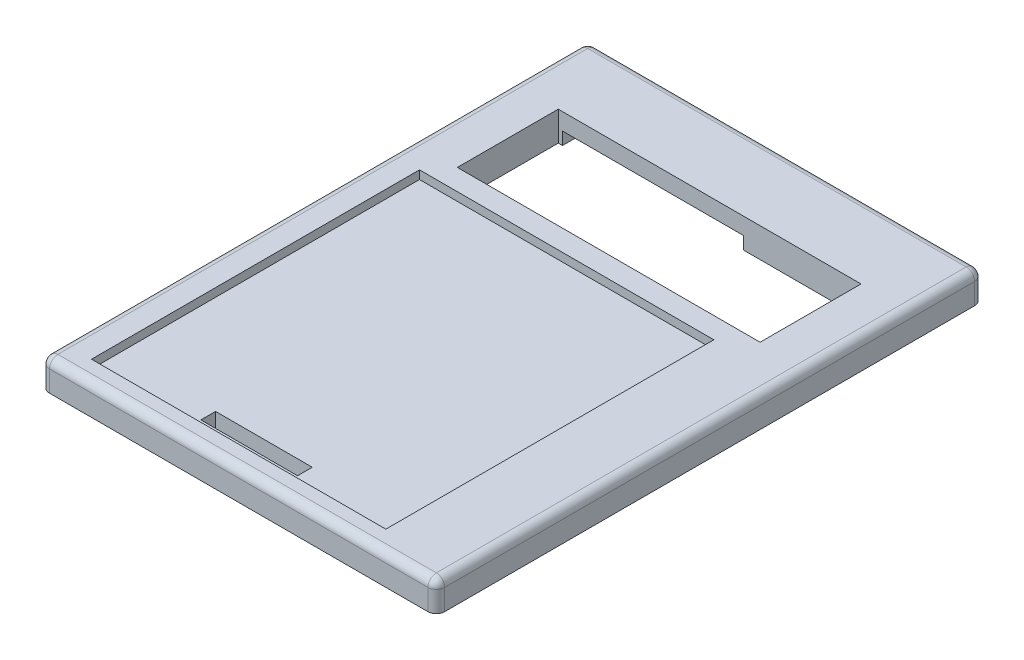
ISO-10303-21;
HEADER;
FILE_DESCRIPTION(('STEP AP214'),'2;1');
FILE_NAME('part.step','',(''),(''),'','','');
FILE_SCHEMA(('AUTOMOTIVE_DESIGN { 1 0 10303 214 1 1 1 1 }'));
ENDSEC;
DATA;
#1=APPLICATION_CONTEXT('core data for automotive mechanical design processes');
#2=APPLICATION_PROTOCOL_DEFINITION('international standard','automotive_design',2000,#1);
#3=PRODUCT_CONTEXT('',#1,'mechanical');
#4=PRODUCT('Part','Part','',(#3));
#5=PRODUCT_RELATED_PRODUCT_CATEGORY('part','',(#4));
#6=PRODUCT_DEFINITION_FORMATION('','',#4);
#7=PRODUCT_DEFINITION_CONTEXT('part definition',#1,'design');
#8=PRODUCT_DEFINITION('design','',#6,#7);
#9=PRODUCT_DEFINITION_SHAPE('','',#8);
#10=(LENGTH_UNIT() NAMED_UNIT(*) SI_UNIT(.MILLI.,.METRE.));
#11=(NAMED_UNIT(*) PLANE_ANGLE_UNIT() SI_UNIT($,.RADIAN.));
#12=(NAMED_UNIT(*) SI_UNIT($,.STERADIAN.) SOLID_ANGLE_UNIT());
#13=UNCERTAINTY_MEASURE_WITH_UNIT(LENGTH_MEASURE(1.E-05),#10,'distance_accuracy_value','');
#14=(GEOMETRIC_REPRESENTATION_CONTEXT(3) GLOBAL_UNCERTAINTY_ASSIGNED_CONTEXT((#13)) GLOBAL_UNIT_ASSIGNED_CONTEXT((#10,
#11,#12)) REPRESENTATION_CONTEXT('',''));
#15=CARTESIAN_POINT('',(0.,0.,0.));
#16=DIRECTION('',(0.,0.,1.));
#17=DIRECTION('',(1.,0.,0.));
#18=AXIS2_PLACEMENT_3D('',#15,#16,#17);
#19=CARTESIAN_POINT('',(0.,7.,0.));
#20=DIRECTION('',(1.,0.,0.));
#21=DIRECTION('',(0.,0.,-1.));
#22=AXIS2_PLACEMENT_3D('',#19,#20,#21);
#23=PLANE('',#22);
#24=DIRECTION('',(0.,0.,1.));
#25=VECTOR('',#24,1.);
#26=CARTESIAN_POINT('',(0.,5.,0.));
#27=LINE('',#26,#25);
#28=CARTESIAN_POINT('',(0.,5.,-2.));
#29=VERTEX_POINT('',#28);
#30=CARTESIAN_POINT('',(0.,5.,-128.));
#31=VERTEX_POINT('',#30);
#32=EDGE_CURVE('E506',#29,#31,#27,.F.);
#33=ORIENTED_EDGE('',*,*,#32,.T.);
#34=DIRECTION('',(0.,-1.,0.));
#35=VECTOR('',#34,1.);
#36=CARTESIAN_POINT('',(0.,7.,-128.));
#37=LINE('',#36,#35);
#38=CARTESIAN_POINT('',(0.,0.,-128.));
#39=VERTEX_POINT('',#38);
#40=EDGE_CURVE('E512',#31,#39,#37,.T.);
#41=ORIENTED_EDGE('',*,*,#40,.T.);
#42=DIRECTION('',(0.,0.,1.));
#43=VECTOR('',#42,1.);
#44=CARTESIAN_POINT('',(0.,0.,0.));
#45=LINE('',#44,#43);
#46=CARTESIAN_POINT('',(0.,0.,-2.));
#47=VERTEX_POINT('',#46);
#48=EDGE_CURVE('E450',#39,#47,#45,.T.);
#49=ORIENTED_EDGE('',*,*,#48,.T.);
#50=DIRECTION('',(0.,-1.,0.));
#51=VECTOR('',#50,1.);
#52=CARTESIAN_POINT('',(0.,7.,-2.));
#53=LINE('',#52,#51);
#54=EDGE_CURVE('E509',#47,#29,#53,.F.);
#55=ORIENTED_EDGE('',*,*,#54,.T.);
#56=EDGE_LOOP('',(#33,#41,#49,#55));
#57=FACE_BOUND('',#56,.T.);
#58=ADVANCED_FACE('F39',(#57),#23,.F.);
#59=CARTESIAN_POINT('',(0.,7.,0.));
#60=DIRECTION('',(0.,0.,-1.));
#61=DIRECTION('',(-1.,0.,0.));
#62=AXIS2_PLACEMENT_3D('',#59,#60,#61);
#63=PLANE('',#62);
#64=DIRECTION('',(1.,0.,0.));
#65=VECTOR('',#64,1.);
#66=CARTESIAN_POINT('',(0.,5.,0.));
#67=LINE('',#66,#65);
#68=CARTESIAN_POINT('',(92.,5.,0.));
#69=VERTEX_POINT('',#68);
#70=CARTESIAN_POINT('',(2.,5.,0.));
#71=VERTEX_POINT('',#70);
#72=EDGE_CURVE('E515',#69,#71,#67,.F.);
#73=ORIENTED_EDGE('',*,*,#72,.T.);
#74=DIRECTION('',(0.,-1.,0.));
#75=VECTOR('',#74,1.);
#76=CARTESIAN_POINT('',(2.,7.,0.));
#77=LINE('',#76,#75);
#78=CARTESIAN_POINT('',(2.,0.,0.));
#79=VERTEX_POINT('',#78);
#80=EDGE_CURVE('E521',#71,#79,#77,.T.);
#81=ORIENTED_EDGE('',*,*,#80,.T.);
#82=DIRECTION('',(1.,0.,0.));
#83=VECTOR('',#82,1.);
#84=CARTESIAN_POINT('',(0.,0.,0.));
#85=LINE('',#84,#83);
#86=CARTESIAN_POINT('',(92.,0.,0.));
#87=VERTEX_POINT('',#86);
#88=EDGE_CURVE('E463',#79,#87,#85,.T.);
#89=ORIENTED_EDGE('',*,*,#88,.T.);
#90=DIRECTION('',(0.,-1.,0.));
#91=VECTOR('',#90,1.);
#92=CARTESIAN_POINT('',(92.,7.,0.));
#93=LINE('',#92,#91);
#94=EDGE_CURVE('E518',#87,#69,#93,.F.);
#95=ORIENTED_EDGE('',*,*,#94,.T.);
#96=EDGE_LOOP('',(#73,#81,#89,#95));
#97=FACE_BOUND('',#96,.T.);
#98=ADVANCED_FACE('F590',(#97),#63,.F.);
#99=CARTESIAN_POINT('',(94.,7.,0.));
#100=DIRECTION('',(-1.,0.,0.));
#101=DIRECTION('',(0.,0.,1.));
#102=AXIS2_PLACEMENT_3D('',#99,#100,#101);
#103=PLANE('',#102);
#104=DIRECTION('',(0.,0.,-1.));
#105=VECTOR('',#104,1.);
#106=CARTESIAN_POINT('',(94.,0.,0.));
#107=LINE('',#106,#105);
#108=CARTESIAN_POINT('',(94.,0.,-2.));
#109=VERTEX_POINT('',#108);
#110=CARTESIAN_POINT('',(94.,0.,-128.));
#111=VERTEX_POINT('',#110);
#112=EDGE_CURVE('E467',#109,#111,#107,.T.);
#113=ORIENTED_EDGE('',*,*,#112,.T.);
#114=DIRECTION('',(0.,-1.,0.));
#115=VECTOR('',#114,1.);
#116=CARTESIAN_POINT('',(94.,7.,-128.));
#117=LINE('',#116,#115);
#118=CARTESIAN_POINT('',(94.,5.,-128.));
#119=VERTEX_POINT('',#118);
#120=EDGE_CURVE('E503',#111,#119,#117,.F.);
#121=ORIENTED_EDGE('',*,*,#120,.T.);
#122=DIRECTION('',(0.,0.,-1.));
#123=VECTOR('',#122,1.);
#124=CARTESIAN_POINT('',(94.,5.,0.));
#125=LINE('',#124,#123);
#126=CARTESIAN_POINT('',(94.,5.,-2.));
#127=VERTEX_POINT('',#126);
#128=EDGE_CURVE('E497',#119,#127,#125,.F.);
#129=ORIENTED_EDGE('',*,*,#128,.T.);
#130=DIRECTION('',(0.,-1.,0.));
#131=VECTOR('',#130,1.);
#132=CARTESIAN_POINT('',(94.,7.,-2.));
#133=LINE('',#132,#131);
#134=EDGE_CURVE('E500',#127,#109,#133,.T.);
#135=ORIENTED_EDGE('',*,*,#134,.T.);
#136=EDGE_LOOP('',(#113,#121,#129,#135));
#137=FACE_BOUND('',#136,.T.);
#138=ADVANCED_FACE('F628',(#137),#103,.F.);
#139=CARTESIAN_POINT('',(0.,7.,-130.));
#140=DIRECTION('',(0.,0.,1.));
#141=DIRECTION('',(1.,0.,0.));
#142=AXIS2_PLACEMENT_3D('',#139,#140,#141);
#143=PLANE('',#142);
#144=DIRECTION('',(-1.,0.,0.));
#145=VECTOR('',#144,1.);
#146=CARTESIAN_POINT('',(0.,5.,-130.));
#147=LINE('',#146,#145);
#148=CARTESIAN_POINT('',(2.,5.,-130.));
#149=VERTEX_POINT('',#148);
#150=CARTESIAN_POINT('',(92.,5.,-130.));
#151=VERTEX_POINT('',#150);
#152=EDGE_CURVE('E475',#149,#151,#147,.F.);
#153=ORIENTED_EDGE('',*,*,#152,.T.);
#154=DIRECTION('',(0.,-1.,0.));
#155=VECTOR('',#154,1.);
#156=CARTESIAN_POINT('',(92.,7.,-130.));
#157=LINE('',#156,#155);
#158=CARTESIAN_POINT('',(92.,0.,-130.));
#159=VERTEX_POINT('',#158);
#160=EDGE_CURVE('E481',#151,#159,#157,.T.);
#161=ORIENTED_EDGE('',*,*,#160,.T.);
#162=DIRECTION('',(-1.,0.,0.));
#163=VECTOR('',#162,1.);
#164=CARTESIAN_POINT('',(0.,0.,-130.));
#165=LINE('',#164,#163);
#166=CARTESIAN_POINT('',(2.,0.,-130.));
#167=VERTEX_POINT('',#166);
#168=EDGE_CURVE('E471',#159,#167,#165,.T.);
#169=ORIENTED_EDGE('',*,*,#168,.T.);
#170=DIRECTION('',(0.,-1.,0.));
#171=VECTOR('',#170,1.);
#172=CARTESIAN_POINT('',(2.,7.,-130.));
#173=LINE('',#172,#171);
#174=EDGE_CURVE('E478',#167,#149,#173,.F.);
#175=ORIENTED_EDGE('',*,*,#174,.T.);
#176=EDGE_LOOP('',(#153,#161,#169,#175));
#177=FACE_BOUND('',#176,.T.);
#178=ADVANCED_FACE('F619',(#177),#143,.F.);
#179=CARTESIAN_POINT('',(0.,7.,0.));
#180=DIRECTION('',(0.,-1.,0.));
#181=DIRECTION('',(0.,0.,-1.));
#182=AXIS2_PLACEMENT_3D('',#179,#180,#181);
#183=PLANE('',#182);
#184=DIRECTION('',(0.,0.,1.));
#185=VECTOR('',#184,1.);
#186=CARTESIAN_POINT('',(2.,7.,0.));
#187=LINE('',#186,#185);
#188=CARTESIAN_POINT('',(2.,7.,-128.));
#189=VERTEX_POINT('',#188);
#190=CARTESIAN_POINT('',(2.,7.,-2.));
#191=VERTEX_POINT('',#190);
#192=EDGE_CURVE('E524',#189,#191,#187,.T.);
#193=ORIENTED_EDGE('',*,*,#192,.T.);
#194=DIRECTION('',(1.,0.,0.));
#195=VECTOR('',#194,1.);
#196=CARTESIAN_POINT('',(0.,7.,-2.));
#197=LINE('',#196,#195);
#198=CARTESIAN_POINT('',(92.,7.,-2.));
#199=VERTEX_POINT('',#198);
#200=EDGE_CURVE('E11',#191,#199,#197,.T.);
#201=ORIENTED_EDGE('',*,*,#200,.T.);
#202=DIRECTION('',(0.,0.,-1.));
#203=VECTOR('',#202,1.);
#204=CARTESIAN_POINT('',(92.,7.,0.));
#205=LINE('',#204,#203);
#206=CARTESIAN_POINT('',(92.,7.,-128.));
#207=VERTEX_POINT('',#206);
#208=EDGE_CURVE('E49',#199,#207,#205,.T.);
#209=ORIENTED_EDGE('',*,*,#208,.T.);
#210=DIRECTION('',(-1.,0.,0.));
#211=VECTOR('',#210,1.);
#212=CARTESIAN_POINT('',(0.,7.,-128.));
#213=LINE('',#212,#211);
#214=EDGE_CURVE('E527',#207,#189,#213,.T.);
#215=ORIENTED_EDGE('',*,*,#214,.T.);
#216=EDGE_LOOP('',(#193,#201,#209,#215));
#217=FACE_BOUND('',#216,.T.);
#218=DIRECTION('',(1.,0.,0.));
#219=VECTOR('',#218,1.);
#220=CARTESIAN_POINT('',(7.00000000000001,7.,-5.));
#221=LINE('',#220,#219);
#222=CARTESIAN_POINT('',(7.00000000000001,7.,-5.));
#223=VERTEX_POINT('',#222);
#224=CARTESIAN_POINT('',(77.,7.,-5.));
#225=VERTEX_POINT('',#224);
#226=EDGE_CURVE('E313',#223,#225,#221,.T.);
#227=ORIENTED_EDGE('',*,*,#226,.F.);
#228=DIRECTION('',(0.,0.,1.));
#229=VECTOR('',#228,1.);
#230=CARTESIAN_POINT('',(7.,7.,-83.));
#231=LINE('',#230,#229);
#232=CARTESIAN_POINT('',(7.,7.,-83.));
#233=VERTEX_POINT('',#232);
#234=EDGE_CURVE('E287',#233,#223,#231,.T.);
#235=ORIENTED_EDGE('',*,*,#234,.F.);
#236=DIRECTION('',(-1.,0.,0.));
#237=VECTOR('',#236,1.);
#238=CARTESIAN_POINT('',(7.,7.,-83.));
#239=LINE('',#238,#237);
#240=CARTESIAN_POINT('',(77.,7.,-83.));
#241=VERTEX_POINT('',#240);
#242=EDGE_CURVE('E298',#241,#233,#239,.T.);
#243=ORIENTED_EDGE('',*,*,#242,.F.);
#244=DIRECTION('',(0.,0.,-1.));
#245=VECTOR('',#244,1.);
#246=CARTESIAN_POINT('',(77.,7.,-83.));
#247=LINE('',#246,#245);
#248=EDGE_CURVE('E317',#225,#241,#247,.T.);
#249=ORIENTED_EDGE('',*,*,#248,.F.);
#250=EDGE_LOOP('',(#227,#235,#243,#249));
#251=FACE_BOUND('',#250,.T.);
#252=DIRECTION('',(1.,0.,0.));
#253=VECTOR('',#252,1.);
#254=CARTESIAN_POINT('',(11.,7.,-88.));
#255=LINE('',#254,#253);
#256=CARTESIAN_POINT('',(11.,7.,-88.));
#257=VERTEX_POINT('',#256);
#258=CARTESIAN_POINT('',(83.,7.,-88.));
#259=VERTEX_POINT('',#258);
#260=EDGE_CURVE('E436',#257,#259,#255,.T.);
#261=ORIENTED_EDGE('',*,*,#260,.F.);
#262=DIRECTION('',(0.,0.,1.));
#263=VECTOR('',#262,1.);
#264=CARTESIAN_POINT('',(11.,7.,-112.));
#265=LINE('',#264,#263);
#266=CARTESIAN_POINT('',(11.,7.,-112.));
#267=VERTEX_POINT('',#266);
#268=EDGE_CURVE('E404',#267,#257,#265,.T.);
#269=ORIENTED_EDGE('',*,*,#268,.F.);
#270=DIRECTION('',(-1.,0.,0.));
#271=VECTOR('',#270,1.);
#272=CARTESIAN_POINT('',(11.,7.,-112.));
#273=LINE('',#272,#271);
#274=CARTESIAN_POINT('',(83.,7.,-112.));
#275=VERTEX_POINT('',#274);
#276=EDGE_CURVE('E419',#275,#267,#273,.T.);
#277=ORIENTED_EDGE('',*,*,#276,.F.);
#278=DIRECTION('',(0.,0.,-1.));
#279=VECTOR('',#278,1.);
#280=CARTESIAN_POINT('',(83.,7.,-112.));
#281=LINE('',#280,#279);
#282=EDGE_CURVE('E440',#259,#275,#281,.T.);
#283=ORIENTED_EDGE('',*,*,#282,.F.);
#284=EDGE_LOOP('',(#261,#269,#277,#283));
#285=FACE_BOUND('',#284,.T.);
#286=ADVANCED_FACE('F604',(#217,#251,#285),#183,.F.);
#287=CARTESIAN_POINT('',(0.,0.,0.));
#288=DIRECTION('',(0.,-1.,0.));
#289=DIRECTION('',(0.,0.,-1.));
#290=AXIS2_PLACEMENT_3D('',#287,#288,#289);
#291=PLANE('',#290);
#292=DIRECTION('',(0.,0.,1.));
#293=VECTOR('',#292,1.);
#294=CARTESIAN_POINT('',(30.5,0.,-11.));
#295=LINE('',#294,#293);
#296=CARTESIAN_POINT('',(30.5,0.,-11.));
#297=VERTEX_POINT('',#296);
#298=CARTESIAN_POINT('',(30.5,0.,-7.5));
#299=VERTEX_POINT('',#298);
#300=EDGE_CURVE('E241',#297,#299,#295,.T.);
#301=ORIENTED_EDGE('',*,*,#300,.T.);
#302=DIRECTION('',(1.,0.,0.));
#303=VECTOR('',#302,1.);
#304=CARTESIAN_POINT('',(30.5,0.,-7.5));
#305=LINE('',#304,#303);
#306=CARTESIAN_POINT('',(53.5,0.,-7.5));
#307=VERTEX_POINT('',#306);
#308=EDGE_CURVE('E254',#299,#307,#305,.T.);
#309=ORIENTED_EDGE('',*,*,#308,.T.);
#310=DIRECTION('',(0.,0.,-1.));
#311=VECTOR('',#310,1.);
#312=CARTESIAN_POINT('',(53.5,0.,-11.));
#313=LINE('',#312,#311);
#314=CARTESIAN_POINT('',(53.5,0.,-11.));
#315=VERTEX_POINT('',#314);
#316=EDGE_CURVE('E259',#307,#315,#313,.T.);
#317=ORIENTED_EDGE('',*,*,#316,.T.);
#318=DIRECTION('',(-1.,0.,0.));
#319=VECTOR('',#318,1.);
#320=CARTESIAN_POINT('',(30.5,0.,-11.));
#321=LINE('',#320,#319);
#322=EDGE_CURVE('E250',#315,#297,#321,.T.);
#323=ORIENTED_EDGE('',*,*,#322,.T.);
#324=EDGE_LOOP('',(#301,#309,#317,#323));
#325=FACE_BOUND('',#324,.T.);
#326=DIRECTION('',(0.,0.,1.));
#327=VECTOR('',#326,1.);
#328=CARTESIAN_POINT('',(55.,0.,-119.5));
#329=LINE('',#328,#327);
#330=CARTESIAN_POINT('',(55.,0.,-119.5));
#331=VERTEX_POINT('',#330);
#332=CARTESIAN_POINT('',(55.,0.,-112.));
#333=VERTEX_POINT('',#332);
#334=EDGE_CURVE('E327',#331,#333,#329,.T.);
#335=ORIENTED_EDGE('',*,*,#334,.F.);
#336=DIRECTION('',(1.,0.,0.));
#337=VECTOR('',#336,1.);
#338=CARTESIAN_POINT('',(55.,0.,-119.5));
#339=LINE('',#338,#337);
#340=CARTESIAN_POINT('',(12.,0.,-119.5));
#341=VERTEX_POINT('',#340);
#342=EDGE_CURVE('E341',#341,#331,#339,.T.);
#343=ORIENTED_EDGE('',*,*,#342,.F.);
#344=DIRECTION('',(0.,0.,-1.));
#345=VECTOR('',#344,1.);
#346=CARTESIAN_POINT('',(12.,0.,-119.5));
#347=LINE('',#346,#345);
#348=CARTESIAN_POINT('',(12.,0.,-112.));
#349=VERTEX_POINT('',#348);
#350=EDGE_CURVE('E356',#349,#341,#347,.T.);
#351=ORIENTED_EDGE('',*,*,#350,.F.);
#352=DIRECTION('',(-1.,0.,0.));
#353=VECTOR('',#352,1.);
#354=CARTESIAN_POINT('',(11.,0.,-112.));
#355=LINE('',#354,#353);
#356=CARTESIAN_POINT('',(11.,0.,-112.));
#357=VERTEX_POINT('',#356);
#358=EDGE_CURVE('E428',#349,#357,#355,.T.);
#359=ORIENTED_EDGE('',*,*,#358,.T.);
#360=DIRECTION('',(0.,0.,1.));
#361=VECTOR('',#360,1.);
#362=CARTESIAN_POINT('',(11.,0.,-112.));
#363=LINE('',#362,#361);
#364=CARTESIAN_POINT('',(11.,0.,-88.));
#365=VERTEX_POINT('',#364);
#366=EDGE_CURVE('E414',#357,#365,#363,.T.);
#367=ORIENTED_EDGE('',*,*,#366,.T.);
#368=DIRECTION('',(1.,0.,0.));
#369=VECTOR('',#368,1.);
#370=CARTESIAN_POINT('',(11.,0.,-88.));
#371=LINE('',#370,#369);
#372=CARTESIAN_POINT('',(83.,0.,-88.));
#373=VERTEX_POINT('',#372);
#374=EDGE_CURVE('E418',#365,#373,#371,.T.);
#375=ORIENTED_EDGE('',*,*,#374,.T.);
#376=DIRECTION('',(0.,0.,-1.));
#377=VECTOR('',#376,1.);
#378=CARTESIAN_POINT('',(83.,0.,-112.));
#379=LINE('',#378,#377);
#380=CARTESIAN_POINT('',(83.,0.,-91.));
#381=VERTEX_POINT('',#380);
#382=EDGE_CURVE('E424',#373,#381,#379,.T.);
#383=ORIENTED_EDGE('',*,*,#382,.T.);
#384=DIRECTION('',(-1.,0.,0.));
#385=VECTOR('',#384,1.);
#386=CARTESIAN_POINT('',(89.,0.,-91.));
#387=LINE('',#386,#385);
#388=CARTESIAN_POINT('',(89.,0.,-91.));
#389=VERTEX_POINT('',#388);
#390=EDGE_CURVE('E395',#389,#381,#387,.T.);
#391=ORIENTED_EDGE('',*,*,#390,.F.);
#392=DIRECTION('',(0.,0.,1.));
#393=VECTOR('',#392,1.);
#394=CARTESIAN_POINT('',(89.,0.,-109.));
#395=LINE('',#394,#393);
#396=CARTESIAN_POINT('',(89.,0.,-109.));
#397=VERTEX_POINT('',#396);
#398=EDGE_CURVE('E366',#397,#389,#395,.T.);
#399=ORIENTED_EDGE('',*,*,#398,.F.);
#400=DIRECTION('',(1.,0.,0.));
#401=VECTOR('',#400,1.);
#402=CARTESIAN_POINT('',(89.,0.,-109.));
#403=LINE('',#402,#401);
#404=CARTESIAN_POINT('',(83.,0.,-109.));
#405=VERTEX_POINT('',#404);
#406=EDGE_CURVE('E381',#405,#397,#403,.T.);
#407=ORIENTED_EDGE('',*,*,#406,.F.);
#408=CARTESIAN_POINT('',(83.,0.,-112.));
#409=VERTEX_POINT('',#408);
#410=EDGE_CURVE('E423',#405,#409,#379,.T.);
#411=ORIENTED_EDGE('',*,*,#410,.T.);
#412=EDGE_CURVE('E429',#409,#333,#355,.T.);
#413=ORIENTED_EDGE('',*,*,#412,.T.);
#414=EDGE_LOOP('',(#335,#343,#351,#359,#367,#375,#383,#391,#399,#407,#411,#413));
#415=FACE_BOUND('',#414,.T.);
#416=ORIENTED_EDGE('',*,*,#168,.F.);
#417=CARTESIAN_POINT('',(92.,0.,-128.));
#418=DIRECTION('',(0.,-1.,0.));
#419=DIRECTION('',(0.,0.,-1.));
#420=AXIS2_PLACEMENT_3D('',#417,#418,#419);
#421=CIRCLE('',#420,2.);
#422=EDGE_CURVE('E494',#159,#111,#421,.T.);
#423=ORIENTED_EDGE('',*,*,#422,.T.);
#424=ORIENTED_EDGE('',*,*,#112,.F.);
#425=CARTESIAN_POINT('',(92.,0.,-2.));
#426=DIRECTION('',(0.,-1.,0.));
#427=DIRECTION('',(0.,0.,-1.));
#428=AXIS2_PLACEMENT_3D('',#425,#426,#427);
#429=CIRCLE('',#428,2.);
#430=EDGE_CURVE('E485',#109,#87,#429,.T.);
#431=ORIENTED_EDGE('',*,*,#430,.T.);
#432=ORIENTED_EDGE('',*,*,#88,.F.);
#433=CARTESIAN_POINT('',(2.,0.,-2.));
#434=DIRECTION('',(0.,-1.,0.));
#435=DIRECTION('',(0.,0.,-1.));
#436=AXIS2_PLACEMENT_3D('',#433,#434,#435);
#437=CIRCLE('',#436,2.);
#438=EDGE_CURVE('E488',#79,#47,#437,.T.);
#439=ORIENTED_EDGE('',*,*,#438,.T.);
#440=ORIENTED_EDGE('',*,*,#48,.F.);
#441=CARTESIAN_POINT('',(2.,0.,-128.));
#442=DIRECTION('',(0.,-1.,0.));
#443=DIRECTION('',(0.,0.,-1.));
#444=AXIS2_PLACEMENT_3D('',#441,#442,#443);
#445=CIRCLE('',#444,2.);
#446=EDGE_CURVE('E491',#39,#167,#445,.T.);
#447=ORIENTED_EDGE('',*,*,#446,.T.);
#448=EDGE_LOOP('',(#416,#423,#424,#431,#432,#439,#440,#447));
#449=FACE_BOUND('',#448,.T.);
#450=ADVANCED_FACE('F261',(#325,#415,#449),#291,.T.);
#451=CARTESIAN_POINT('',(11.,0.,-112.));
#452=DIRECTION('',(-1.,0.,0.));
#453=DIRECTION('',(0.,0.,1.));
#454=AXIS2_PLACEMENT_3D('',#451,#452,#453);
#455=PLANE('',#454);
#456=ORIENTED_EDGE('',*,*,#268,.T.);
#457=DIRECTION('',(0.,1.,0.));
#458=VECTOR('',#457,1.);
#459=CARTESIAN_POINT('',(11.,0.,-88.));
#460=LINE('',#459,#458);
#461=EDGE_CURVE('E433',#365,#257,#460,.T.);
#462=ORIENTED_EDGE('',*,*,#461,.F.);
#463=ORIENTED_EDGE('',*,*,#366,.F.);
#464=DIRECTION('',(0.,1.,0.));
#465=VECTOR('',#464,1.);
#466=CARTESIAN_POINT('',(11.,0.,-112.));
#467=LINE('',#466,#465);
#468=EDGE_CURVE('E447',#357,#267,#467,.T.);
#469=ORIENTED_EDGE('',*,*,#468,.T.);
#470=EDGE_LOOP('',(#456,#462,#463,#469));
#471=FACE_BOUND('',#470,.T.);
#472=ADVANCED_FACE('F908',(#471),#455,.F.);
#473=CARTESIAN_POINT('',(11.,0.,-112.));
#474=DIRECTION('',(0.,0.,-1.));
#475=DIRECTION('',(-1.,0.,0.));
#476=AXIS2_PLACEMENT_3D('',#473,#474,#475);
#477=PLANE('',#476);
#478=DIRECTION('',(-1.,0.,0.));
#479=VECTOR('',#478,1.);
#480=CARTESIAN_POINT('',(55.,3.,-112.));
#481=LINE('',#480,#479);
#482=CARTESIAN_POINT('',(55.,3.,-112.));
#483=VERTEX_POINT('',#482);
#484=CARTESIAN_POINT('',(12.,3.,-112.));
#485=VERTEX_POINT('',#484);
#486=EDGE_CURVE('E340',#483,#485,#481,.T.);
#487=ORIENTED_EDGE('',*,*,#486,.F.);
#488=DIRECTION('',(0.,-1.,0.));
#489=VECTOR('',#488,1.);
#490=CARTESIAN_POINT('',(55.,3.,-112.));
#491=LINE('',#490,#489);
#492=EDGE_CURVE('E353',#483,#333,#491,.T.);
#493=ORIENTED_EDGE('',*,*,#492,.T.);
#494=ORIENTED_EDGE('',*,*,#412,.F.);
#495=DIRECTION('',(0.,1.,0.));
#496=VECTOR('',#495,1.);
#497=CARTESIAN_POINT('',(83.,0.,-112.));
#498=LINE('',#497,#496);
#499=EDGE_CURVE('E451',#409,#275,#498,.T.);
#500=ORIENTED_EDGE('',*,*,#499,.T.);
#501=ORIENTED_EDGE('',*,*,#276,.T.);
#502=ORIENTED_EDGE('',*,*,#468,.F.);
#503=ORIENTED_EDGE('',*,*,#358,.F.);
#504=DIRECTION('',(0.,-1.,0.));
#505=VECTOR('',#504,1.);
#506=CARTESIAN_POINT('',(12.,3.,-112.));
#507=LINE('',#506,#505);
#508=EDGE_CURVE('E370',#485,#349,#507,.T.);
#509=ORIENTED_EDGE('',*,*,#508,.F.);
#510=EDGE_LOOP('',(#487,#493,#494,#500,#501,#502,#503,#509));
#511=FACE_BOUND('',#510,.T.);
#512=ADVANCED_FACE('F900',(#511),#477,.F.);
#513=CARTESIAN_POINT('',(83.,0.,-112.));
#514=DIRECTION('',(1.,0.,0.));
#515=DIRECTION('',(0.,0.,-1.));
#516=AXIS2_PLACEMENT_3D('',#513,#514,#515);
#517=PLANE('',#516);
#518=ORIENTED_EDGE('',*,*,#410,.F.);
#519=DIRECTION('',(0.,-1.,0.));
#520=VECTOR('',#519,1.);
#521=CARTESIAN_POINT('',(83.,3.5,-109.));
#522=LINE('',#521,#520);
#523=CARTESIAN_POINT('',(83.,3.5,-109.));
#524=VERTEX_POINT('',#523);
#525=EDGE_CURVE('E405',#524,#405,#522,.T.);
#526=ORIENTED_EDGE('',*,*,#525,.F.);
#527=DIRECTION('',(0.,0.,-1.));
#528=VECTOR('',#527,1.);
#529=CARTESIAN_POINT('',(83.,3.5,-109.));
#530=LINE('',#529,#528);
#531=CARTESIAN_POINT('',(83.,3.5,-91.));
#532=VERTEX_POINT('',#531);
#533=EDGE_CURVE('E384',#532,#524,#530,.T.);
#534=ORIENTED_EDGE('',*,*,#533,.F.);
#535=DIRECTION('',(0.,-1.,0.));
#536=VECTOR('',#535,1.);
#537=CARTESIAN_POINT('',(83.,3.5,-91.));
#538=LINE('',#537,#536);
#539=EDGE_CURVE('E408',#532,#381,#538,.T.);
#540=ORIENTED_EDGE('',*,*,#539,.T.);
#541=ORIENTED_EDGE('',*,*,#382,.F.);
#542=DIRECTION('',(0.,1.,0.));
#543=VECTOR('',#542,1.);
#544=CARTESIAN_POINT('',(83.,0.,-88.));
#545=LINE('',#544,#543);
#546=EDGE_CURVE('E454',#373,#259,#545,.T.);
#547=ORIENTED_EDGE('',*,*,#546,.T.);
#548=ORIENTED_EDGE('',*,*,#282,.T.);
#549=ORIENTED_EDGE('',*,*,#499,.F.);
#550=EDGE_LOOP('',(#518,#526,#534,#540,#541,#547,#548,#549));
#551=FACE_BOUND('',#550,.T.);
#552=ADVANCED_FACE('F891',(#551),#517,.F.);
#553=CARTESIAN_POINT('',(11.,0.,-88.));
#554=DIRECTION('',(0.,0.,1.));
#555=DIRECTION('',(1.,0.,0.));
#556=AXIS2_PLACEMENT_3D('',#553,#554,#555);
#557=PLANE('',#556);
#558=ORIENTED_EDGE('',*,*,#260,.T.);
#559=ORIENTED_EDGE('',*,*,#546,.F.);
#560=ORIENTED_EDGE('',*,*,#374,.F.);
#561=ORIENTED_EDGE('',*,*,#461,.T.);
#562=EDGE_LOOP('',(#558,#559,#560,#561));
#563=FACE_BOUND('',#562,.T.);
#564=ADVANCED_FACE('F881',(#563),#557,.F.);
#565=CARTESIAN_POINT('',(89.,3.5,-109.));
#566=DIRECTION('',(1.,0.,0.));
#567=DIRECTION('',(0.,0.,-1.));
#568=AXIS2_PLACEMENT_3D('',#565,#566,#567);
#569=PLANE('',#568);
#570=ORIENTED_EDGE('',*,*,#398,.T.);
#571=DIRECTION('',(0.,-1.,0.));
#572=VECTOR('',#571,1.);
#573=CARTESIAN_POINT('',(89.,3.5,-91.));
#574=LINE('',#573,#572);
#575=CARTESIAN_POINT('',(89.,3.5,-91.));
#576=VERTEX_POINT('',#575);
#577=EDGE_CURVE('E391',#576,#389,#574,.T.);
#578=ORIENTED_EDGE('',*,*,#577,.F.);
#579=DIRECTION('',(0.,0.,1.));
#580=VECTOR('',#579,1.);
#581=CARTESIAN_POINT('',(89.,3.5,-109.));
#582=LINE('',#581,#580);
#583=CARTESIAN_POINT('',(89.,3.5,-109.));
#584=VERTEX_POINT('',#583);
#585=EDGE_CURVE('E376',#584,#576,#582,.T.);
#586=ORIENTED_EDGE('',*,*,#585,.F.);
#587=DIRECTION('',(0.,-1.,0.));
#588=VECTOR('',#587,1.);
#589=CARTESIAN_POINT('',(89.,3.5,-109.));
#590=LINE('',#589,#588);
#591=EDGE_CURVE('E401',#584,#397,#590,.T.);
#592=ORIENTED_EDGE('',*,*,#591,.T.);
#593=EDGE_LOOP('',(#570,#578,#586,#592));
#594=FACE_BOUND('',#593,.T.);
#595=ADVANCED_FACE('F872',(#594),#569,.F.);
#596=CARTESIAN_POINT('',(89.,3.5,-109.));
#597=DIRECTION('',(0.,0.,-1.));
#598=DIRECTION('',(-1.,0.,0.));
#599=AXIS2_PLACEMENT_3D('',#596,#597,#598);
#600=PLANE('',#599);
#601=ORIENTED_EDGE('',*,*,#406,.T.);
#602=ORIENTED_EDGE('',*,*,#591,.F.);
#603=DIRECTION('',(1.,0.,0.));
#604=VECTOR('',#603,1.);
#605=CARTESIAN_POINT('',(89.,3.5,-109.));
#606=LINE('',#605,#604);
#607=EDGE_CURVE('E387',#524,#584,#606,.T.);
#608=ORIENTED_EDGE('',*,*,#607,.F.);
#609=ORIENTED_EDGE('',*,*,#525,.T.);
#610=EDGE_LOOP('',(#601,#602,#608,#609));
#611=FACE_BOUND('',#610,.T.);
#612=ADVANCED_FACE('F863',(#611),#600,.F.);
#613=CARTESIAN_POINT('',(89.,3.5,-91.));
#614=DIRECTION('',(0.,0.,1.));
#615=DIRECTION('',(1.,0.,0.));
#616=AXIS2_PLACEMENT_3D('',#613,#614,#615);
#617=PLANE('',#616);
#618=ORIENTED_EDGE('',*,*,#390,.T.);
#619=ORIENTED_EDGE('',*,*,#539,.F.);
#620=DIRECTION('',(-1.,0.,0.));
#621=VECTOR('',#620,1.);
#622=CARTESIAN_POINT('',(89.,3.5,-91.));
#623=LINE('',#622,#621);
#624=EDGE_CURVE('E380',#576,#532,#623,.T.);
#625=ORIENTED_EDGE('',*,*,#624,.F.);
#626=ORIENTED_EDGE('',*,*,#577,.T.);
#627=EDGE_LOOP('',(#618,#619,#625,#626));
#628=FACE_BOUND('',#627,.T.);
#629=ADVANCED_FACE('F854',(#628),#617,.F.);
#630=CARTESIAN_POINT('',(0.,3.5,0.));
#631=DIRECTION('',(0.,-1.,0.));
#632=DIRECTION('',(0.,0.,-1.));
#633=AXIS2_PLACEMENT_3D('',#630,#631,#632);
#634=PLANE('',#633);
#635=ORIENTED_EDGE('',*,*,#585,.T.);
#636=ORIENTED_EDGE('',*,*,#624,.T.);
#637=ORIENTED_EDGE('',*,*,#533,.T.);
#638=ORIENTED_EDGE('',*,*,#607,.T.);
#639=EDGE_LOOP('',(#635,#636,#637,#638));
#640=FACE_BOUND('',#639,.T.);
#641=ADVANCED_FACE('F844',(#640),#634,.T.);
#642=CARTESIAN_POINT('',(55.,3.,-119.5));
#643=DIRECTION('',(1.,0.,0.));
#644=DIRECTION('',(0.,0.,-1.));
#645=AXIS2_PLACEMENT_3D('',#642,#643,#644);
#646=PLANE('',#645);
#647=ORIENTED_EDGE('',*,*,#334,.T.);
#648=ORIENTED_EDGE('',*,*,#492,.F.);
#649=DIRECTION('',(0.,0.,1.));
#650=VECTOR('',#649,1.);
#651=CARTESIAN_POINT('',(55.,3.,-119.5));
#652=LINE('',#651,#650);
#653=CARTESIAN_POINT('',(55.,3.,-119.5));
#654=VERTEX_POINT('',#653);
#655=EDGE_CURVE('E337',#654,#483,#652,.T.);
#656=ORIENTED_EDGE('',*,*,#655,.F.);
#657=DIRECTION('',(0.,-1.,0.));
#658=VECTOR('',#657,1.);
#659=CARTESIAN_POINT('',(55.,3.,-119.5));
#660=LINE('',#659,#658);
#661=EDGE_CURVE('E363',#654,#331,#660,.T.);
#662=ORIENTED_EDGE('',*,*,#661,.T.);
#663=EDGE_LOOP('',(#647,#648,#656,#662));
#664=FACE_BOUND('',#663,.T.);
#665=ADVANCED_FACE('F835',(#664),#646,.F.);
#666=CARTESIAN_POINT('',(55.,3.,-119.5));
#667=DIRECTION('',(0.,0.,-1.));
#668=DIRECTION('',(-1.,0.,0.));
#669=AXIS2_PLACEMENT_3D('',#666,#667,#668);
#670=PLANE('',#669);
#671=ORIENTED_EDGE('',*,*,#342,.T.);
#672=ORIENTED_EDGE('',*,*,#661,.F.);
#673=DIRECTION('',(1.,0.,0.));
#674=VECTOR('',#673,1.);
#675=CARTESIAN_POINT('',(55.,3.,-119.5));
#676=LINE('',#675,#674);
#677=CARTESIAN_POINT('',(12.,3.,-119.5));
#678=VERTEX_POINT('',#677);
#679=EDGE_CURVE('E349',#678,#654,#676,.T.);
#680=ORIENTED_EDGE('',*,*,#679,.F.);
#681=DIRECTION('',(0.,-1.,0.));
#682=VECTOR('',#681,1.);
#683=CARTESIAN_POINT('',(12.,3.,-119.5));
#684=LINE('',#683,#682);
#685=EDGE_CURVE('E367',#678,#341,#684,.T.);
#686=ORIENTED_EDGE('',*,*,#685,.T.);
#687=EDGE_LOOP('',(#671,#672,#680,#686));
#688=FACE_BOUND('',#687,.T.);
#689=ADVANCED_FACE('F826',(#688),#670,.F.);
#690=CARTESIAN_POINT('',(12.,3.,-119.5));
#691=DIRECTION('',(-1.,0.,0.));
#692=DIRECTION('',(0.,0.,1.));
#693=AXIS2_PLACEMENT_3D('',#690,#691,#692);
#694=PLANE('',#693);
#695=ORIENTED_EDGE('',*,*,#350,.T.);
#696=ORIENTED_EDGE('',*,*,#685,.F.);
#697=DIRECTION('',(0.,0.,-1.));
#698=VECTOR('',#697,1.);
#699=CARTESIAN_POINT('',(12.,3.,-119.5));
#700=LINE('',#699,#698);
#701=EDGE_CURVE('E345',#485,#678,#700,.T.);
#702=ORIENTED_EDGE('',*,*,#701,.F.);
#703=ORIENTED_EDGE('',*,*,#508,.T.);
#704=EDGE_LOOP('',(#695,#696,#702,#703));
#705=FACE_BOUND('',#704,.T.);
#706=ADVANCED_FACE('F817',(#705),#694,.F.);
#707=CARTESIAN_POINT('',(0.,3.,0.));
#708=DIRECTION('',(0.,-1.,0.));
#709=DIRECTION('',(0.,0.,-1.));
#710=AXIS2_PLACEMENT_3D('',#707,#708,#709);
#711=PLANE('',#710);
#712=ORIENTED_EDGE('',*,*,#655,.T.);
#713=ORIENTED_EDGE('',*,*,#486,.T.);
#714=ORIENTED_EDGE('',*,*,#701,.T.);
#715=ORIENTED_EDGE('',*,*,#679,.T.);
#716=EDGE_LOOP('',(#712,#713,#714,#715));
#717=FACE_BOUND('',#716,.T.);
#718=ADVANCED_FACE('F808',(#717),#711,.T.);
#719=CARTESIAN_POINT('',(7.,5.,-83.));
#720=DIRECTION('',(-1.,0.,0.));
#721=DIRECTION('',(0.,0.,1.));
#722=AXIS2_PLACEMENT_3D('',#719,#720,#721);
#723=PLANE('',#722);
#724=ORIENTED_EDGE('',*,*,#234,.T.);
#725=DIRECTION('',(0.,1.,0.));
#726=VECTOR('',#725,1.);
#727=CARTESIAN_POINT('',(7.00000000000001,5.,-5.));
#728=LINE('',#727,#726);
#729=CARTESIAN_POINT('',(7.00000000000001,5.,-5.));
#730=VERTEX_POINT('',#729);
#731=EDGE_CURVE('E310',#730,#223,#728,.T.);
#732=ORIENTED_EDGE('',*,*,#731,.F.);
#733=DIRECTION('',(0.,0.,1.));
#734=VECTOR('',#733,1.);
#735=CARTESIAN_POINT('',(7.,5.,-83.));
#736=LINE('',#735,#734);
#737=CARTESIAN_POINT('',(7.,5.,-83.));
#738=VERTEX_POINT('',#737);
#739=EDGE_CURVE('E293',#738,#730,#736,.T.);
#740=ORIENTED_EDGE('',*,*,#739,.F.);
#741=DIRECTION('',(0.,1.,0.));
#742=VECTOR('',#741,1.);
#743=CARTESIAN_POINT('',(7.,5.,-83.));
#744=LINE('',#743,#742);
#745=EDGE_CURVE('E324',#738,#233,#744,.T.);
#746=ORIENTED_EDGE('',*,*,#745,.T.);
#747=EDGE_LOOP('',(#724,#732,#740,#746));
#748=FACE_BOUND('',#747,.T.);
#749=ADVANCED_FACE('F799',(#748),#723,.F.);
#750=CARTESIAN_POINT('',(7.,5.,-83.));
#751=DIRECTION('',(0.,0.,-1.));
#752=DIRECTION('',(-1.,0.,0.));
#753=AXIS2_PLACEMENT_3D('',#750,#751,#752);
#754=PLANE('',#753);
#755=ORIENTED_EDGE('',*,*,#242,.T.);
#756=ORIENTED_EDGE('',*,*,#745,.F.);
#757=DIRECTION('',(-1.,0.,0.));
#758=VECTOR('',#757,1.);
#759=CARTESIAN_POINT('',(7.,5.,-83.));
#760=LINE('',#759,#758);
#761=CARTESIAN_POINT('',(77.,5.,-83.));
#762=VERTEX_POINT('',#761);
#763=EDGE_CURVE('E306',#762,#738,#760,.T.);
#764=ORIENTED_EDGE('',*,*,#763,.F.);
#765=DIRECTION('',(0.,1.,0.));
#766=VECTOR('',#765,1.);
#767=CARTESIAN_POINT('',(77.,5.,-83.));
#768=LINE('',#767,#766);
#769=EDGE_CURVE('E328',#762,#241,#768,.T.);
#770=ORIENTED_EDGE('',*,*,#769,.T.);
#771=EDGE_LOOP('',(#755,#756,#764,#770));
#772=FACE_BOUND('',#771,.T.);
#773=ADVANCED_FACE('F790',(#772),#754,.F.);
#774=CARTESIAN_POINT('',(77.,5.,-83.));
#775=DIRECTION('',(1.,0.,0.));
#776=DIRECTION('',(0.,0.,-1.));
#777=AXIS2_PLACEMENT_3D('',#774,#775,#776);
#778=PLANE('',#777);
#779=ORIENTED_EDGE('',*,*,#248,.T.);
#780=ORIENTED_EDGE('',*,*,#769,.F.);
#781=DIRECTION('',(0.,0.,-1.));
#782=VECTOR('',#781,1.);
#783=CARTESIAN_POINT('',(77.,5.,-83.));
#784=LINE('',#783,#782);
#785=CARTESIAN_POINT('',(77.,5.,-5.));
#786=VERTEX_POINT('',#785);
#787=EDGE_CURVE('E302',#786,#762,#784,.T.);
#788=ORIENTED_EDGE('',*,*,#787,.F.);
#789=DIRECTION('',(0.,1.,0.));
#790=VECTOR('',#789,1.);
#791=CARTESIAN_POINT('',(77.,5.,-5.));
#792=LINE('',#791,#790);
#793=EDGE_CURVE('E331',#786,#225,#792,.T.);
#794=ORIENTED_EDGE('',*,*,#793,.T.);
#795=EDGE_LOOP('',(#779,#780,#788,#794));
#796=FACE_BOUND('',#795,.T.);
#797=ADVANCED_FACE('F781',(#796),#778,.F.);
#798=CARTESIAN_POINT('',(7.00000000000001,5.,-5.));
#799=DIRECTION('',(0.,0.,1.));
#800=DIRECTION('',(1.,0.,0.));
#801=AXIS2_PLACEMENT_3D('',#798,#799,#800);
#802=PLANE('',#801);
#803=ORIENTED_EDGE('',*,*,#226,.T.);
#804=ORIENTED_EDGE('',*,*,#793,.F.);
#805=DIRECTION('',(1.,0.,0.));
#806=VECTOR('',#805,1.);
#807=CARTESIAN_POINT('',(7.00000000000001,5.,-5.));
#808=LINE('',#807,#806);
#809=EDGE_CURVE('E297',#730,#786,#808,.T.);
#810=ORIENTED_EDGE('',*,*,#809,.F.);
#811=ORIENTED_EDGE('',*,*,#731,.T.);
#812=EDGE_LOOP('',(#803,#804,#810,#811));
#813=FACE_BOUND('',#812,.T.);
#814=ADVANCED_FACE('F772',(#813),#802,.F.);
#815=CARTESIAN_POINT('',(0.,5.,0.));
#816=DIRECTION('',(0.,1.,0.));
#817=DIRECTION('',(0.,0.,1.));
#818=AXIS2_PLACEMENT_3D('',#815,#816,#817);
#819=PLANE('',#818);
#820=DIRECTION('',(0.,0.,1.));
#821=VECTOR('',#820,1.);
#822=CARTESIAN_POINT('',(30.5,5.,-11.));
#823=LINE('',#822,#821);
#824=CARTESIAN_POINT('',(30.5,5.,-11.));
#825=VERTEX_POINT('',#824);
#826=CARTESIAN_POINT('',(30.5,5.,-7.5));
#827=VERTEX_POINT('',#826);
#828=EDGE_CURVE('E244',#825,#827,#823,.T.);
#829=ORIENTED_EDGE('',*,*,#828,.F.);
#830=DIRECTION('',(-1.,0.,0.));
#831=VECTOR('',#830,1.);
#832=CARTESIAN_POINT('',(30.5,5.,-11.));
#833=LINE('',#832,#831);
#834=CARTESIAN_POINT('',(53.5,5.,-11.));
#835=VERTEX_POINT('',#834);
#836=EDGE_CURVE('E265',#835,#825,#833,.T.);
#837=ORIENTED_EDGE('',*,*,#836,.F.);
#838=DIRECTION('',(0.,0.,-1.));
#839=VECTOR('',#838,1.);
#840=CARTESIAN_POINT('',(53.5,5.,-11.));
#841=LINE('',#840,#839);
#842=CARTESIAN_POINT('',(53.5,5.,-7.5));
#843=VERTEX_POINT('',#842);
#844=EDGE_CURVE('E269',#843,#835,#841,.T.);
#845=ORIENTED_EDGE('',*,*,#844,.F.);
#846=DIRECTION('',(1.,0.,0.));
#847=VECTOR('',#846,1.);
#848=CARTESIAN_POINT('',(30.5,5.,-7.5));
#849=LINE('',#848,#847);
#850=EDGE_CURVE('E278',#827,#843,#849,.T.);
#851=ORIENTED_EDGE('',*,*,#850,.F.);
#852=EDGE_LOOP('',(#829,#837,#845,#851));
#853=FACE_BOUND('',#852,.T.);
#854=ORIENTED_EDGE('',*,*,#739,.T.);
#855=ORIENTED_EDGE('',*,*,#809,.T.);
#856=ORIENTED_EDGE('',*,*,#787,.T.);
#857=ORIENTED_EDGE('',*,*,#763,.T.);
#858=EDGE_LOOP('',(#854,#855,#856,#857));
#859=FACE_BOUND('',#858,.T.);
#860=ADVANCED_FACE('F764',(#853,#859),#819,.T.);
#861=CARTESIAN_POINT('',(30.5,0.,-11.));
#862=DIRECTION('',(-1.,0.,0.));
#863=DIRECTION('',(0.,0.,1.));
#864=AXIS2_PLACEMENT_3D('',#861,#862,#863);
#865=PLANE('',#864);
#866=ORIENTED_EDGE('',*,*,#828,.T.);
#867=DIRECTION('',(0.,1.,0.));
#868=VECTOR('',#867,1.);
#869=CARTESIAN_POINT('',(30.5,0.,-7.5));
#870=LINE('',#869,#868);
#871=EDGE_CURVE('E237',#299,#827,#870,.T.);
#872=ORIENTED_EDGE('',*,*,#871,.F.);
#873=ORIENTED_EDGE('',*,*,#300,.F.);
#874=DIRECTION('',(0.,1.,0.));
#875=VECTOR('',#874,1.);
#876=CARTESIAN_POINT('',(30.5,0.,-11.));
#877=LINE('',#876,#875);
#878=EDGE_CURVE('E284',#297,#825,#877,.T.);
#879=ORIENTED_EDGE('',*,*,#878,.T.);
#880=EDGE_LOOP('',(#866,#872,#873,#879));
#881=FACE_BOUND('',#880,.T.);
#882=ADVANCED_FACE('F239',(#881),#865,.F.);
#883=CARTESIAN_POINT('',(30.5,0.,-11.));
#884=DIRECTION('',(0.,0.,-1.));
#885=DIRECTION('',(-1.,0.,0.));
#886=AXIS2_PLACEMENT_3D('',#883,#884,#885);
#887=PLANE('',#886);
#888=ORIENTED_EDGE('',*,*,#836,.T.);
#889=ORIENTED_EDGE('',*,*,#878,.F.);
#890=ORIENTED_EDGE('',*,*,#322,.F.);
#891=DIRECTION('',(0.,1.,0.));
#892=VECTOR('',#891,1.);
#893=CARTESIAN_POINT('',(53.5,0.,-11.));
#894=LINE('',#893,#892);
#895=EDGE_CURVE('E288',#315,#835,#894,.T.);
#896=ORIENTED_EDGE('',*,*,#895,.T.);
#897=EDGE_LOOP('',(#888,#889,#890,#896));
#898=FACE_BOUND('',#897,.T.);
#899=ADVANCED_FACE('F747',(#898),#887,.F.);
#900=CARTESIAN_POINT('',(53.5,0.,-11.));
#901=DIRECTION('',(1.,0.,0.));
#902=DIRECTION('',(0.,0.,-1.));
#903=AXIS2_PLACEMENT_3D('',#900,#901,#902);
#904=PLANE('',#903);
#905=ORIENTED_EDGE('',*,*,#844,.T.);
#906=ORIENTED_EDGE('',*,*,#895,.F.);
#907=ORIENTED_EDGE('',*,*,#316,.F.);
#908=DIRECTION('',(0.,1.,0.));
#909=VECTOR('',#908,1.);
#910=CARTESIAN_POINT('',(53.5,0.,-7.5));
#911=LINE('',#910,#909);
#912=EDGE_CURVE('E249',#307,#843,#911,.T.);
#913=ORIENTED_EDGE('',*,*,#912,.T.);
#914=EDGE_LOOP('',(#905,#906,#907,#913));
#915=FACE_BOUND('',#914,.T.);
#916=ADVANCED_FACE('F739',(#915),#904,.F.);
#917=CARTESIAN_POINT('',(30.5,0.,-7.5));
#918=DIRECTION('',(0.,0.,1.));
#919=DIRECTION('',(1.,0.,0.));
#920=AXIS2_PLACEMENT_3D('',#917,#918,#919);
#921=PLANE('',#920);
#922=ORIENTED_EDGE('',*,*,#850,.T.);
#923=ORIENTED_EDGE('',*,*,#912,.F.);
#924=ORIENTED_EDGE('',*,*,#308,.F.);
#925=ORIENTED_EDGE('',*,*,#871,.T.);
#926=EDGE_LOOP('',(#922,#923,#924,#925));
#927=FACE_BOUND('',#926,.T.);
#928=ADVANCED_FACE('F255',(#927),#921,.F.);
#929=CARTESIAN_POINT('',(2.,7.,-2.));
#930=DIRECTION('',(0.,-1.,0.));
#931=DIRECTION('',(0.,0.,-1.));
#932=AXIS2_PLACEMENT_3D('',#929,#930,#931);
#933=CYLINDRICAL_SURFACE('',#932,2.);
#934=CARTESIAN_POINT('',(2.,5.,-2.));
#935=DIRECTION('',(0.,1.,0.));
#936=DIRECTION('',(0.,0.,1.));
#937=AXIS2_PLACEMENT_3D('',#934,#935,#936);
#938=CIRCLE('',#937,2.);
#939=EDGE_CURVE('E43',#29,#71,#938,.T.);
#940=ORIENTED_EDGE('',*,*,#939,.F.);
#941=ORIENTED_EDGE('',*,*,#54,.F.);
#942=ORIENTED_EDGE('',*,*,#438,.F.);
#943=ORIENTED_EDGE('',*,*,#80,.F.);
#944=EDGE_LOOP('',(#940,#941,#942,#943));
#945=FACE_BOUND('',#944,.T.);
#946=ADVANCED_FACE('F41',(#945),#933,.T.);
#947=CARTESIAN_POINT('',(2.,5.,-2.));
#948=DIRECTION('',(0.,0.,1.));
#949=DIRECTION('',(1.,0.,0.));
#950=AXIS2_PLACEMENT_3D('',#947,#948,#949);
#951=SPHERICAL_SURFACE('',#950,2.);
#952=CARTESIAN_POINT('',(2.,5.,-2.));
#953=DIRECTION('',(0.,0.,1.));
#954=DIRECTION('',(1.,0.,0.));
#955=AXIS2_PLACEMENT_3D('',#952,#953,#954);
#956=CIRCLE('',#955,2.);
#957=EDGE_CURVE('E567',#29,#191,#956,.F.);
#958=ORIENTED_EDGE('',*,*,#957,.F.);
#959=ORIENTED_EDGE('',*,*,#939,.T.);
#960=CARTESIAN_POINT('',(2.,5.,-2.));
#961=DIRECTION('',(-1.,0.,0.));
#962=DIRECTION('',(0.,0.,1.));
#963=AXIS2_PLACEMENT_3D('',#960,#961,#962);
#964=CIRCLE('',#963,2.);
#965=EDGE_CURVE('E570',#191,#71,#964,.F.);
#966=ORIENTED_EDGE('',*,*,#965,.F.);
#967=EDGE_LOOP('',(#958,#959,#966));
#968=FACE_BOUND('',#967,.T.);
#969=ADVANCED_FACE('F582',(#968),#951,.T.);
#970=CARTESIAN_POINT('',(92.,7.,-2.));
#971=DIRECTION('',(0.,-1.,0.));
#972=DIRECTION('',(0.,0.,-1.));
#973=AXIS2_PLACEMENT_3D('',#970,#971,#972);
#974=CYLINDRICAL_SURFACE('',#973,2.);
#975=ORIENTED_EDGE('',*,*,#430,.F.);
#976=ORIENTED_EDGE('',*,*,#134,.F.);
#977=CARTESIAN_POINT('',(92.,5.,-2.));
#978=DIRECTION('',(0.,1.,0.));
#979=DIRECTION('',(0.,0.,1.));
#980=AXIS2_PLACEMENT_3D('',#977,#978,#979);
#981=CIRCLE('',#980,2.);
#982=EDGE_CURVE('E563',#69,#127,#981,.T.);
#983=ORIENTED_EDGE('',*,*,#982,.F.);
#984=ORIENTED_EDGE('',*,*,#94,.F.);
#985=EDGE_LOOP('',(#975,#976,#983,#984));
#986=FACE_BOUND('',#985,.T.);
#987=ADVANCED_FACE('F599',(#986),#974,.T.);
#988=CARTESIAN_POINT('',(0.,5.,-2.));
#989=DIRECTION('',(1.,0.,0.));
#990=DIRECTION('',(0.,0.,-1.));
#991=AXIS2_PLACEMENT_3D('',#988,#989,#990);
#992=CYLINDRICAL_SURFACE('',#991,2.);
#993=ORIENTED_EDGE('',*,*,#965,.T.);
#994=ORIENTED_EDGE('',*,*,#72,.F.);
#995=CARTESIAN_POINT('',(92.,5.,-2.));
#996=DIRECTION('',(1.,0.,0.));
#997=DIRECTION('',(0.,0.,-1.));
#998=AXIS2_PLACEMENT_3D('',#995,#996,#997);
#999=CIRCLE('',#998,2.);
#1000=EDGE_CURVE('E559',#199,#69,#999,.T.);
#1001=ORIENTED_EDGE('',*,*,#1000,.F.);
#1002=ORIENTED_EDGE('',*,*,#200,.F.);
#1003=EDGE_LOOP('',(#993,#994,#1001,#1002));
#1004=FACE_BOUND('',#1003,.T.);
#1005=ADVANCED_FACE('F602',(#1004),#992,.T.);
#1006=CARTESIAN_POINT('',(2.,5.,0.));
#1007=DIRECTION('',(0.,0.,1.));
#1008=DIRECTION('',(1.,0.,0.));
#1009=AXIS2_PLACEMENT_3D('',#1006,#1007,#1008);
#1010=CYLINDRICAL_SURFACE('',#1009,2.);
#1011=ORIENTED_EDGE('',*,*,#957,.T.);
#1012=ORIENTED_EDGE('',*,*,#192,.F.);
#1013=CARTESIAN_POINT('',(2.,5.,-128.));
#1014=DIRECTION('',(0.,0.,-1.));
#1015=DIRECTION('',(-1.,0.,0.));
#1016=AXIS2_PLACEMENT_3D('',#1013,#1014,#1015);
#1017=CIRCLE('',#1016,2.);
#1018=EDGE_CURVE('E555',#31,#189,#1017,.T.);
#1019=ORIENTED_EDGE('',*,*,#1018,.F.);
#1020=ORIENTED_EDGE('',*,*,#32,.F.);
#1021=EDGE_LOOP('',(#1011,#1012,#1019,#1020));
#1022=FACE_BOUND('',#1021,.T.);
#1023=ADVANCED_FACE('F609',(#1022),#1010,.T.);
#1024=CARTESIAN_POINT('',(2.,7.,-128.));
#1025=DIRECTION('',(0.,-1.,0.));
#1026=DIRECTION('',(0.,0.,-1.));
#1027=AXIS2_PLACEMENT_3D('',#1024,#1025,#1026);
#1028=CYLINDRICAL_SURFACE('',#1027,2.);
#1029=ORIENTED_EDGE('',*,*,#446,.F.);
#1030=ORIENTED_EDGE('',*,*,#40,.F.);
#1031=CARTESIAN_POINT('',(2.,5.,-128.));
#1032=DIRECTION('',(0.,1.,0.));
#1033=DIRECTION('',(0.,0.,1.));
#1034=AXIS2_PLACEMENT_3D('',#1031,#1032,#1033);
#1035=CIRCLE('',#1034,2.);
#1036=EDGE_CURVE('E551',#149,#31,#1035,.T.);
#1037=ORIENTED_EDGE('',*,*,#1036,.F.);
#1038=ORIENTED_EDGE('',*,*,#174,.F.);
#1039=EDGE_LOOP('',(#1029,#1030,#1037,#1038));
#1040=FACE_BOUND('',#1039,.T.);
#1041=ADVANCED_FACE('F615',(#1040),#1028,.T.);
#1042=CARTESIAN_POINT('',(92.,5.,-2.));
#1043=DIRECTION('',(0.,0.,1.));
#1044=DIRECTION('',(1.,0.,0.));
#1045=AXIS2_PLACEMENT_3D('',#1042,#1043,#1044);
#1046=SPHERICAL_SURFACE('',#1045,2.);
#1047=ORIENTED_EDGE('',*,*,#1000,.T.);
#1048=ORIENTED_EDGE('',*,*,#982,.T.);
#1049=CARTESIAN_POINT('',(92.,5.,-2.));
#1050=DIRECTION('',(0.,0.,1.));
#1051=DIRECTION('',(1.,0.,0.));
#1052=AXIS2_PLACEMENT_3D('',#1049,#1050,#1051);
#1053=CIRCLE('',#1052,2.);
#1054=EDGE_CURVE('E548',#199,#127,#1053,.F.);
#1055=ORIENTED_EDGE('',*,*,#1054,.F.);
#1056=EDGE_LOOP('',(#1047,#1048,#1055));
#1057=FACE_BOUND('',#1056,.T.);
#1058=ADVANCED_FACE('F638',(#1057),#1046,.T.);
#1059=CARTESIAN_POINT('',(2.,5.,-128.));
#1060=DIRECTION('',(0.,0.,1.));
#1061=DIRECTION('',(1.,0.,0.));
#1062=AXIS2_PLACEMENT_3D('',#1059,#1060,#1061);
#1063=SPHERICAL_SURFACE('',#1062,2.);
#1064=ORIENTED_EDGE('',*,*,#1036,.T.);
#1065=ORIENTED_EDGE('',*,*,#1018,.T.);
#1066=CARTESIAN_POINT('',(2.,5.,-128.));
#1067=DIRECTION('',(-1.,0.,0.));
#1068=DIRECTION('',(0.,0.,1.));
#1069=AXIS2_PLACEMENT_3D('',#1066,#1067,#1068);
#1070=CIRCLE('',#1069,2.);
#1071=EDGE_CURVE('E544',#149,#189,#1070,.F.);
#1072=ORIENTED_EDGE('',*,*,#1071,.F.);
#1073=EDGE_LOOP('',(#1064,#1065,#1072));
#1074=FACE_BOUND('',#1073,.T.);
#1075=ADVANCED_FACE('F636',(#1074),#1063,.T.);
#1076=CARTESIAN_POINT('',(92.,5.,0.));
#1077=DIRECTION('',(0.,0.,-1.));
#1078=DIRECTION('',(-1.,0.,0.));
#1079=AXIS2_PLACEMENT_3D('',#1076,#1077,#1078);
#1080=CYLINDRICAL_SURFACE('',#1079,2.);
#1081=ORIENTED_EDGE('',*,*,#1054,.T.);
#1082=ORIENTED_EDGE('',*,*,#128,.F.);
#1083=CARTESIAN_POINT('',(92.,5.,-128.));
#1084=DIRECTION('',(0.,0.,-1.));
#1085=DIRECTION('',(-1.,0.,0.));
#1086=AXIS2_PLACEMENT_3D('',#1083,#1084,#1085);
#1087=CIRCLE('',#1086,2.);
#1088=EDGE_CURVE('E540',#207,#119,#1087,.T.);
#1089=ORIENTED_EDGE('',*,*,#1088,.F.);
#1090=ORIENTED_EDGE('',*,*,#208,.F.);
#1091=EDGE_LOOP('',(#1081,#1082,#1089,#1090));
#1092=FACE_BOUND('',#1091,.T.);
#1093=ADVANCED_FACE('F630',(#1092),#1080,.T.);
#1094=CARTESIAN_POINT('',(0.,5.,-128.));
#1095=DIRECTION('',(-1.,0.,0.));
#1096=DIRECTION('',(0.,0.,1.));
#1097=AXIS2_PLACEMENT_3D('',#1094,#1095,#1096);
#1098=CYLINDRICAL_SURFACE('',#1097,2.);
#1099=ORIENTED_EDGE('',*,*,#1071,.T.);
#1100=ORIENTED_EDGE('',*,*,#214,.F.);
#1101=CARTESIAN_POINT('',(92.,5.,-128.));
#1102=DIRECTION('',(1.,0.,0.));
#1103=DIRECTION('',(0.,0.,-1.));
#1104=AXIS2_PLACEMENT_3D('',#1101,#1102,#1103);
#1105=CIRCLE('',#1104,2.);
#1106=EDGE_CURVE('E536',#151,#207,#1105,.T.);
#1107=ORIENTED_EDGE('',*,*,#1106,.F.);
#1108=ORIENTED_EDGE('',*,*,#152,.F.);
#1109=EDGE_LOOP('',(#1099,#1100,#1107,#1108));
#1110=FACE_BOUND('',#1109,.T.);
#1111=ADVANCED_FACE('F634',(#1110),#1098,.T.);
#1112=CARTESIAN_POINT('',(92.,5.,-128.));
#1113=DIRECTION('',(0.,0.,1.));
#1114=DIRECTION('',(1.,0.,0.));
#1115=AXIS2_PLACEMENT_3D('',#1112,#1113,#1114);
#1116=SPHERICAL_SURFACE('',#1115,2.);
#1117=ORIENTED_EDGE('',*,*,#1106,.T.);
#1118=ORIENTED_EDGE('',*,*,#1088,.T.);
#1119=CARTESIAN_POINT('',(92.,5.,-128.));
#1120=DIRECTION('',(0.,1.,0.));
#1121=DIRECTION('',(0.,0.,1.));
#1122=AXIS2_PLACEMENT_3D('',#1119,#1120,#1121);
#1123=CIRCLE('',#1122,2.);
#1124=EDGE_CURVE('E532',#151,#119,#1123,.F.);
#1125=ORIENTED_EDGE('',*,*,#1124,.F.);
#1126=EDGE_LOOP('',(#1117,#1118,#1125));
#1127=FACE_BOUND('',#1126,.T.);
#1128=ADVANCED_FACE('F632',(#1127),#1116,.T.);
#1129=CARTESIAN_POINT('',(92.,7.,-128.));
#1130=DIRECTION('',(0.,-1.,0.));
#1131=DIRECTION('',(0.,0.,-1.));
#1132=AXIS2_PLACEMENT_3D('',#1129,#1130,#1131);
#1133=CYLINDRICAL_SURFACE('',#1132,2.);
#1134=ORIENTED_EDGE('',*,*,#1124,.T.);
#1135=ORIENTED_EDGE('',*,*,#120,.F.);
#1136=ORIENTED_EDGE('',*,*,#422,.F.);
#1137=ORIENTED_EDGE('',*,*,#160,.F.);
#1138=EDGE_LOOP('',(#1134,#1135,#1136,#1137));
#1139=FACE_BOUND('',#1138,.T.);
#1140=ADVANCED_FACE('F624',(#1139),#1133,.T.);
#1141=CLOSED_SHELL('',(#58,#98,#138,#178,#286,#450,#472,#512,#552,#564,#595,#612,#629,#641,#665,
#689,#706,#718,#749,#773,#797,#814,#860,#882,#899,#916,#928,#946,#969,#987,#1005,#1023,#1041,
#1058,#1075,#1093,#1111,#1128,#1140));
#1142=MANIFOLD_SOLID_BREP('B2',#1141);
#1143=ADVANCED_BREP_SHAPE_REPRESENTATION('',(#18,#1142),#14);
#1144=SHAPE_DEFINITION_REPRESENTATION(#9,#1143);
ENDSEC;
END-ISO-10303-21;
